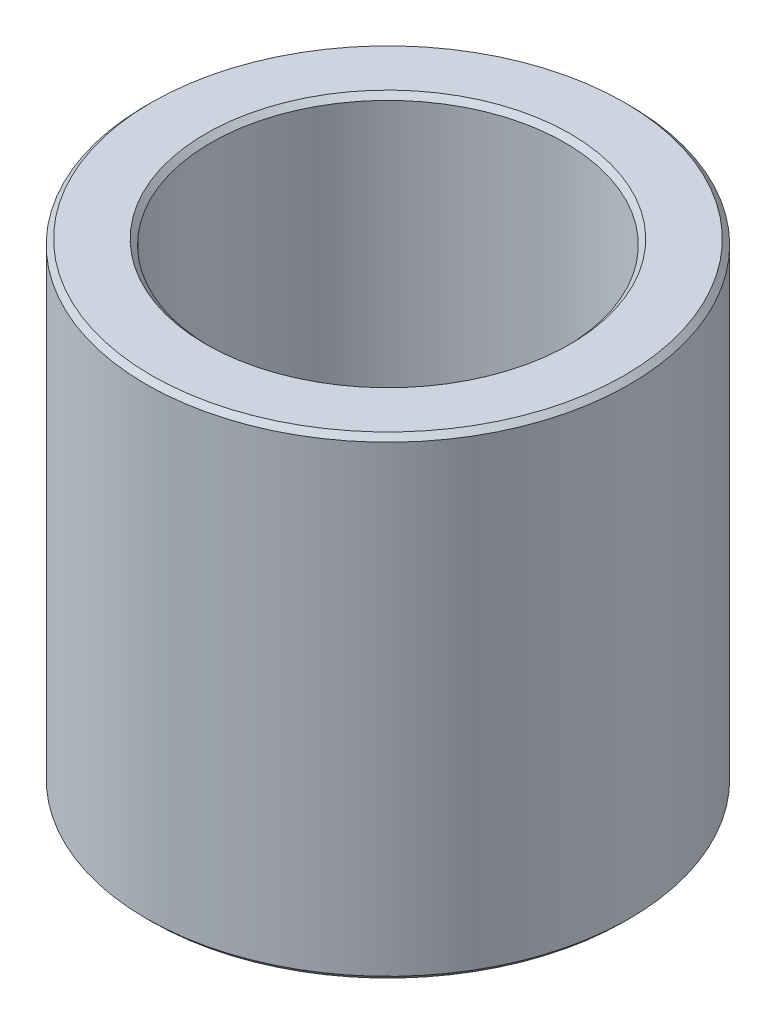
ISO-10303-21;
HEADER;
FILE_DESCRIPTION(('STEP AP214'),'2;1');
FILE_NAME('part.step','',(''),(''),'','','');
FILE_SCHEMA(('AUTOMOTIVE_DESIGN { 1 0 10303 214 1 1 1 1 }'));
ENDSEC;
DATA;
#1=APPLICATION_CONTEXT('core data for automotive mechanical design processes');
#2=APPLICATION_PROTOCOL_DEFINITION('international standard','automotive_design',2000,#1);
#3=PRODUCT_CONTEXT('',#1,'mechanical');
#4=PRODUCT('Part','Part','',(#3));
#5=PRODUCT_RELATED_PRODUCT_CATEGORY('part','',(#4));
#6=PRODUCT_DEFINITION_FORMATION('','',#4);
#7=PRODUCT_DEFINITION_CONTEXT('part definition',#1,'design');
#8=PRODUCT_DEFINITION('design','',#6,#7);
#9=PRODUCT_DEFINITION_SHAPE('','',#8);
#10=(LENGTH_UNIT() NAMED_UNIT(*) SI_UNIT(.MILLI.,.METRE.));
#11=(NAMED_UNIT(*) PLANE_ANGLE_UNIT() SI_UNIT($,.RADIAN.));
#12=(NAMED_UNIT(*) SI_UNIT($,.STERADIAN.) SOLID_ANGLE_UNIT());
#13=UNCERTAINTY_MEASURE_WITH_UNIT(LENGTH_MEASURE(1.E-05),#10,'distance_accuracy_value','');
#14=(GEOMETRIC_REPRESENTATION_CONTEXT(3) GLOBAL_UNCERTAINTY_ASSIGNED_CONTEXT((#13)) GLOBAL_UNIT_ASSIGNED_CONTEXT((#10,
#11,#12)) REPRESENTATION_CONTEXT('',''));
#15=CARTESIAN_POINT('',(0.,0.,0.));
#16=DIRECTION('',(0.,0.,1.));
#17=DIRECTION('',(1.,0.,0.));
#18=AXIS2_PLACEMENT_3D('',#15,#16,#17);
#19=CARTESIAN_POINT('',(0.,63.6074111493279,0.));
#20=DIRECTION('',(0.,-1.,0.));
#21=DIRECTION('',(0.,0.,-1.));
#22=AXIS2_PLACEMENT_3D('',#19,#20,#21);
#23=CYLINDRICAL_SURFACE('',#22,32.5);
#24=CARTESIAN_POINT('',(0.,0.70100998527281,0.));
#25=DIRECTION('',(0.,1.,0.));
#26=DIRECTION('',(0.,0.,1.));
#27=AXIS2_PLACEMENT_3D('',#24,#25,#26);
#28=CIRCLE('',#27,32.5);
#29=CARTESIAN_POINT('',(0.,0.70100998527281,32.5));
#30=VERTEX_POINT('',#29);
#31=EDGE_CURVE('E10',#30,#30,#28,.T.);
#32=ORIENTED_EDGE('',*,*,#31,.T.);
#33=EDGE_LOOP('',(#32));
#34=FACE_BOUND('',#33,.T.);
#35=CARTESIAN_POINT('',(0.,62.9085004392417,0.));
#36=DIRECTION('',(0.,1.,0.));
#37=DIRECTION('',(0.,0.,1.));
#38=AXIS2_PLACEMENT_3D('',#35,#36,#37);
#39=CIRCLE('',#38,32.5);
#40=CARTESIAN_POINT('',(0.,62.9085004392417,32.5));
#41=VERTEX_POINT('',#40);
#42=EDGE_CURVE('E50',#41,#41,#39,.F.);
#43=ORIENTED_EDGE('',*,*,#42,.T.);
#44=EDGE_LOOP('',(#43));
#45=FACE_BOUND('',#44,.T.);
#46=ADVANCED_FACE('F39',(#34,#45),#23,.T.);
#47=CARTESIAN_POINT('',(0.,63.6074111493279,0.));
#48=DIRECTION('',(0.,1.,0.));
#49=DIRECTION('',(0.,0.,1.));
#50=AXIS2_PLACEMENT_3D('',#47,#48,#49);
#51=PLANE('',#50);
#52=CARTESIAN_POINT('',(0.,63.6074111493279,0.));
#53=DIRECTION('',(0.,1.,0.));
#54=DIRECTION('',(0.,0.,1.));
#55=AXIS2_PLACEMENT_3D('',#52,#53,#54);
#56=CIRCLE('',#55,24.5143256408505);
#57=CARTESIAN_POINT('',(0.,63.6074111493279,24.5143256408505));
#58=VERTEX_POINT('',#57);
#59=EDGE_CURVE('E58',#58,#58,#56,.F.);
#60=ORIENTED_EDGE('',*,*,#59,.T.);
#61=EDGE_LOOP('',(#60));
#62=FACE_BOUND('',#61,.T.);
#63=CARTESIAN_POINT('',(0.,63.6074111493279,0.));
#64=DIRECTION('',(0.,1.,0.));
#65=DIRECTION('',(0.,0.,1.));
#66=AXIS2_PLACEMENT_3D('',#63,#64,#65);
#67=CIRCLE('',#66,31.7989900147272);
#68=CARTESIAN_POINT('',(0.,63.6074111493279,31.7989900147272));
#69=VERTEX_POINT('',#68);
#70=EDGE_CURVE('E61',#69,#69,#67,.T.);
#71=ORIENTED_EDGE('',*,*,#70,.T.);
#72=EDGE_LOOP('',(#71));
#73=FACE_BOUND('',#72,.T.);
#74=ADVANCED_FACE('F88',(#62,#73),#51,.T.);
#75=CARTESIAN_POINT('',(0.,0.,0.));
#76=DIRECTION('',(0.,1.,0.));
#77=DIRECTION('',(0.,0.,1.));
#78=AXIS2_PLACEMENT_3D('',#75,#76,#77);
#79=PLANE('',#78);
#80=CARTESIAN_POINT('',(0.,0.,0.));
#81=DIRECTION('',(0.,1.,0.));
#82=DIRECTION('',(0.,0.,1.));
#83=AXIS2_PLACEMENT_3D('',#80,#81,#82);
#84=CIRCLE('',#83,24.516424916037);
#85=CARTESIAN_POINT('',(0.,0.,24.516424916037));
#86=VERTEX_POINT('',#85);
#87=EDGE_CURVE('E51',#86,#86,#84,.T.);
#88=ORIENTED_EDGE('',*,*,#87,.T.);
#89=EDGE_LOOP('',(#88));
#90=FACE_BOUND('',#89,.T.);
#91=CARTESIAN_POINT('',(0.,0.,0.));
#92=DIRECTION('',(0.,1.,0.));
#93=DIRECTION('',(0.,0.,1.));
#94=AXIS2_PLACEMENT_3D('',#91,#92,#93);
#95=CIRCLE('',#94,31.8010892899138);
#96=CARTESIAN_POINT('',(0.,0.,31.8010892899138));
#97=VERTEX_POINT('',#96);
#98=EDGE_CURVE('E54',#97,#97,#95,.F.);
#99=ORIENTED_EDGE('',*,*,#98,.T.);
#100=EDGE_LOOP('',(#99));
#101=FACE_BOUND('',#100,.T.);
#102=ADVANCED_FACE('F83',(#90,#101),#79,.F.);
#103=CARTESIAN_POINT('',(0.,63.6074111493279,0.));
#104=DIRECTION('',(0.,-1.,0.));
#105=DIRECTION('',(0.,0.,-1.));
#106=AXIS2_PLACEMENT_3D('',#103,#104,#105);
#107=CYLINDRICAL_SURFACE('',#106,23.8154149307642);
#108=CARTESIAN_POINT('',(0.,62.906401164055,0.));
#109=DIRECTION('',(0.,1.,0.));
#110=DIRECTION('',(0.,0.,1.));
#111=AXIS2_PLACEMENT_3D('',#108,#109,#110);
#112=CIRCLE('',#111,23.8154149307642);
#113=CARTESIAN_POINT('',(0.,62.906401164055,23.8154149307642));
#114=VERTEX_POINT('',#113);
#115=EDGE_CURVE('E67',#114,#114,#112,.T.);
#116=ORIENTED_EDGE('',*,*,#115,.T.);
#117=EDGE_LOOP('',(#116));
#118=FACE_BOUND('',#117,.T.);
#119=CARTESIAN_POINT('',(0.,0.698910710086195,0.));
#120=DIRECTION('',(0.,1.,0.));
#121=DIRECTION('',(0.,0.,1.));
#122=AXIS2_PLACEMENT_3D('',#119,#120,#121);
#123=CIRCLE('',#122,23.8154149307642);
#124=CARTESIAN_POINT('',(0.,0.698910710086195,23.8154149307642));
#125=VERTEX_POINT('',#124);
#126=EDGE_CURVE('E69',#125,#125,#123,.F.);
#127=ORIENTED_EDGE('',*,*,#126,.T.);
#128=EDGE_LOOP('',(#127));
#129=FACE_BOUND('',#128,.T.);
#130=ADVANCED_FACE('F71',(#118,#129),#107,.F.);
#131=CARTESIAN_POINT('',(0.,62.906401164055,0.));
#132=DIRECTION('',(0.,1.,0.));
#133=DIRECTION('',(0.,0.,1.));
#134=AXIS2_PLACEMENT_3D('',#131,#132,#133);
#135=CONICAL_SURFACE('',#134,23.8154149307642,0.783898597300577);
#136=ORIENTED_EDGE('',*,*,#59,.F.);
#137=EDGE_LOOP('',(#136));
#138=FACE_BOUND('',#137,.T.);
#139=ORIENTED_EDGE('',*,*,#115,.F.);
#140=EDGE_LOOP('',(#139));
#141=FACE_BOUND('',#140,.T.);
#142=ADVANCED_FACE('F77',(#138,#141),#135,.F.);
#143=CARTESIAN_POINT('',(0.,0.,0.));
#144=DIRECTION('',(0.,-1.,0.));
#145=DIRECTION('',(0.,0.,-1.));
#146=AXIS2_PLACEMENT_3D('',#143,#144,#145);
#147=CONICAL_SURFACE('',#146,24.516424916037,0.78689772949431);
#148=ORIENTED_EDGE('',*,*,#126,.F.);
#149=EDGE_LOOP('',(#148));
#150=FACE_BOUND('',#149,.T.);
#151=ORIENTED_EDGE('',*,*,#87,.F.);
#152=EDGE_LOOP('',(#151));
#153=FACE_BOUND('',#152,.T.);
#154=ADVANCED_FACE('F73',(#150,#153),#147,.F.);
#155=CARTESIAN_POINT('',(0.,0.70100998527281,0.));
#156=DIRECTION('',(0.,1.,0.));
#157=DIRECTION('',(0.,0.,1.));
#158=AXIS2_PLACEMENT_3D('',#155,#156,#157);
#159=CONICAL_SURFACE('',#158,32.5,0.783898597300587);
#160=ORIENTED_EDGE('',*,*,#98,.F.);
#161=EDGE_LOOP('',(#160));
#162=FACE_BOUND('',#161,.T.);
#163=ORIENTED_EDGE('',*,*,#31,.F.);
#164=EDGE_LOOP('',(#163));
#165=FACE_BOUND('',#164,.T.);
#166=ADVANCED_FACE('F76',(#162,#165),#159,.T.);
#167=CARTESIAN_POINT('',(0.,63.6074111493279,0.));
#168=DIRECTION('',(0.,-1.,0.));
#169=DIRECTION('',(0.,0.,-1.));
#170=AXIS2_PLACEMENT_3D('',#167,#168,#169);
#171=CONICAL_SURFACE('',#170,31.7989900147272,0.78689772949431);
#172=ORIENTED_EDGE('',*,*,#42,.F.);
#173=EDGE_LOOP('',(#172));
#174=FACE_BOUND('',#173,.T.);
#175=ORIENTED_EDGE('',*,*,#70,.F.);
#176=EDGE_LOOP('',(#175));
#177=FACE_BOUND('',#176,.T.);
#178=ADVANCED_FACE('F45',(#174,#177),#171,.T.);
#179=CLOSED_SHELL('',(#46,#74,#102,#130,#142,#154,#166,#178));
#180=MANIFOLD_SOLID_BREP('B2',#179);
#181=ADVANCED_BREP_SHAPE_REPRESENTATION('',(#18,#180),#14);
#182=SHAPE_DEFINITION_REPRESENTATION(#9,#181);
ENDSEC;
END-ISO-10303-21;
